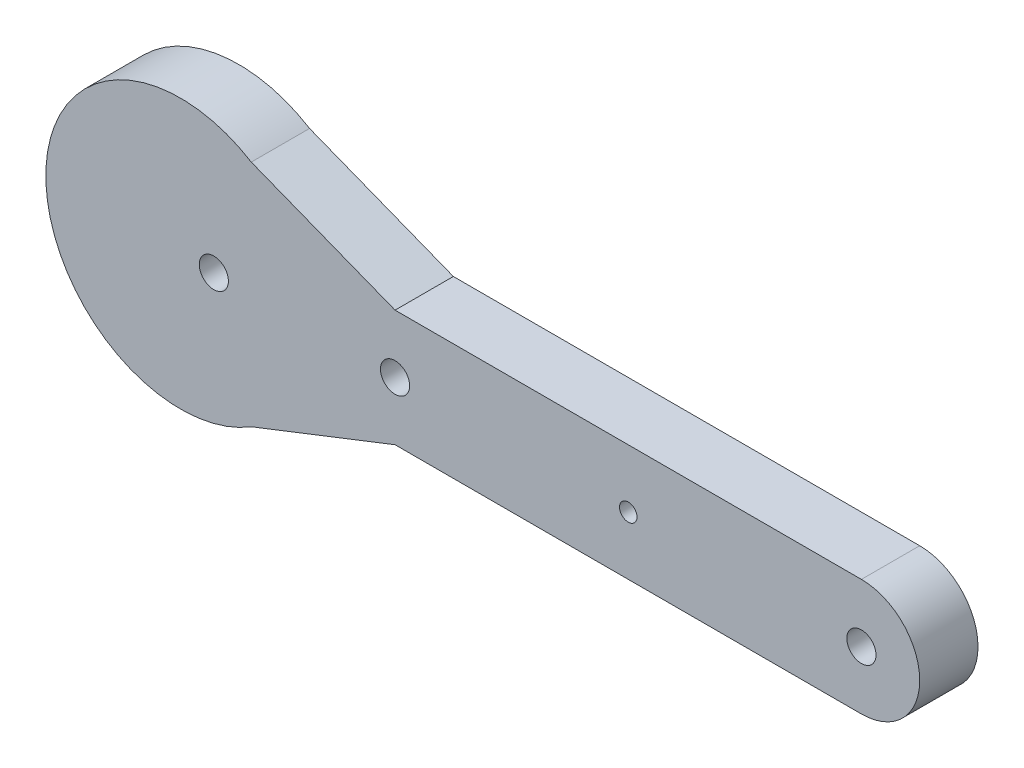
ISO-10303-21;
HEADER;
FILE_DESCRIPTION(('STEP AP214'),'2;1');
FILE_NAME('part.step','',(''),(''),'','','');
FILE_SCHEMA(('AUTOMOTIVE_DESIGN { 1 0 10303 214 1 1 1 1 }'));
ENDSEC;
DATA;
#1=APPLICATION_CONTEXT('core data for automotive mechanical design processes');
#2=APPLICATION_PROTOCOL_DEFINITION('international standard','automotive_design',2000,#1);
#3=PRODUCT_CONTEXT('',#1,'mechanical');
#4=PRODUCT('Part','Part','',(#3));
#5=PRODUCT_RELATED_PRODUCT_CATEGORY('part','',(#4));
#6=PRODUCT_DEFINITION_FORMATION('','',#4);
#7=PRODUCT_DEFINITION_CONTEXT('part definition',#1,'design');
#8=PRODUCT_DEFINITION('design','',#6,#7);
#9=PRODUCT_DEFINITION_SHAPE('','',#8);
#10=(LENGTH_UNIT() NAMED_UNIT(*) SI_UNIT(.MILLI.,.METRE.));
#11=(NAMED_UNIT(*) PLANE_ANGLE_UNIT() SI_UNIT($,.RADIAN.));
#12=(NAMED_UNIT(*) SI_UNIT($,.STERADIAN.) SOLID_ANGLE_UNIT());
#13=UNCERTAINTY_MEASURE_WITH_UNIT(LENGTH_MEASURE(1.E-05),#10,'distance_accuracy_value','');
#14=(GEOMETRIC_REPRESENTATION_CONTEXT(3) GLOBAL_UNCERTAINTY_ASSIGNED_CONTEXT((#13)) GLOBAL_UNIT_ASSIGNED_CONTEXT((#10,
#11,#12)) REPRESENTATION_CONTEXT('',''));
#15=CARTESIAN_POINT('',(0.,0.,0.));
#16=DIRECTION('',(0.,0.,1.));
#17=DIRECTION('',(1.,0.,0.));
#18=AXIS2_PLACEMENT_3D('',#15,#16,#17);
#19=CARTESIAN_POINT('',(-36.8077791148947,10.,10.));
#20=DIRECTION('',(0.,0.,1.));
#21=DIRECTION('',(1.,0.,0.));
#22=AXIS2_PLACEMENT_3D('',#19,#20,#21);
#23=PLANE('',#22);
#24=CARTESIAN_POINT('',(-31.0911194710237,10.,10.));
#25=DIRECTION('',(0.,0.,1.));
#26=DIRECTION('',(1.,0.,0.));
#27=AXIS2_PLACEMENT_3D('',#24,#25,#26);
#28=CIRCLE('',#27,2.5);
#29=CARTESIAN_POINT('',(-28.5911194710237,10.,10.));
#30=VERTEX_POINT('',#29);
#31=EDGE_CURVE('E189',#30,#30,#28,.T.);
#32=ORIENTED_EDGE('',*,*,#31,.F.);
#33=EDGE_LOOP('',(#32));
#34=FACE_BOUND('',#33,.T.);
#35=CARTESIAN_POINT('',(0.,10.,10.));
#36=DIRECTION('',(0.,0.,1.));
#37=DIRECTION('',(1.,0.,0.));
#38=AXIS2_PLACEMENT_3D('',#35,#36,#37);
#39=CIRCLE('',#38,2.5);
#40=CARTESIAN_POINT('',(2.5,10.,10.));
#41=VERTEX_POINT('',#40);
#42=EDGE_CURVE('E122',#41,#41,#39,.T.);
#43=ORIENTED_EDGE('',*,*,#42,.F.);
#44=EDGE_LOOP('',(#43));
#45=FACE_BOUND('',#44,.T.);
#46=DIRECTION('',(0.931166086788449,0.364595280845882,0.));
#47=VECTOR('',#46,1.);
#48=CARTESIAN_POINT('',(0.,0.,10.));
#49=LINE('',#48,#47);
#50=CARTESIAN_POINT('',(-24.6672867580171,-9.65840194445181,10.));
#51=VERTEX_POINT('',#50);
#52=CARTESIAN_POINT('',(0.,0.,10.));
#53=VERTEX_POINT('',#52);
#54=EDGE_CURVE('E129',#51,#53,#49,.T.);
#55=ORIENTED_EDGE('',*,*,#54,.T.);
#56=DIRECTION('',(1.,0.,0.));
#57=VECTOR('',#56,1.);
#58=CARTESIAN_POINT('',(0.,0.,10.));
#59=LINE('',#58,#57);
#60=CARTESIAN_POINT('',(80.,0.,10.));
#61=VERTEX_POINT('',#60);
#62=EDGE_CURVE('E87',#53,#61,#59,.T.);
#63=ORIENTED_EDGE('',*,*,#62,.T.);
#64=CARTESIAN_POINT('',(80.,10.,10.));
#65=DIRECTION('',(0.,0.,1.));
#66=DIRECTION('',(-1.,0.,0.));
#67=AXIS2_PLACEMENT_3D('',#64,#65,#66);
#68=CIRCLE('',#67,10.);
#69=CARTESIAN_POINT('',(80.,20.,10.));
#70=VERTEX_POINT('',#69);
#71=EDGE_CURVE('E100',#61,#70,#68,.T.);
#72=ORIENTED_EDGE('',*,*,#71,.T.);
#73=DIRECTION('',(-1.,0.,0.));
#74=VECTOR('',#73,1.);
#75=CARTESIAN_POINT('',(0.,20.,10.));
#76=LINE('',#75,#74);
#77=CARTESIAN_POINT('',(0.,20.,10.));
#78=VERTEX_POINT('',#77);
#79=EDGE_CURVE('E94',#70,#78,#76,.T.);
#80=ORIENTED_EDGE('',*,*,#79,.T.);
#81=DIRECTION('',(-0.931166086788448,0.364595280845882,0.));
#82=VECTOR('',#81,1.);
#83=CARTESIAN_POINT('',(0.,20.,10.));
#84=LINE('',#83,#82);
#85=CARTESIAN_POINT('',(-24.6672867580171,29.6584019444518,10.));
#86=VERTEX_POINT('',#85);
#87=EDGE_CURVE('E98',#78,#86,#84,.T.);
#88=ORIENTED_EDGE('',*,*,#87,.T.);
#89=CARTESIAN_POINT('',(-36.8077791148947,10.,10.));
#90=DIRECTION('',(0.,0.,1.));
#91=DIRECTION('',(1.,0.,0.));
#92=AXIS2_PLACEMENT_3D('',#89,#90,#91);
#93=CIRCLE('',#92,23.1050713410937);
#94=EDGE_CURVE('E50',#86,#51,#93,.T.);
#95=ORIENTED_EDGE('',*,*,#94,.T.);
#96=EDGE_LOOP('',(#55,#63,#72,#80,#88,#95));
#97=FACE_BOUND('',#96,.T.);
#98=CARTESIAN_POINT('',(80.,10.,10.));
#99=DIRECTION('',(0.,0.,1.));
#100=DIRECTION('',(1.,0.,0.));
#101=AXIS2_PLACEMENT_3D('',#98,#99,#100);
#102=CIRCLE('',#101,2.50000000000001);
#103=CARTESIAN_POINT('',(82.5,10.,10.));
#104=VERTEX_POINT('',#103);
#105=EDGE_CURVE('E195',#104,#104,#102,.T.);
#106=ORIENTED_EDGE('',*,*,#105,.F.);
#107=EDGE_LOOP('',(#106));
#108=FACE_BOUND('',#107,.T.);
#109=CARTESIAN_POINT('',(40.,9.99999999999999,10.));
#110=DIRECTION('',(0.,0.,1.));
#111=DIRECTION('',(1.,0.,0.));
#112=AXIS2_PLACEMENT_3D('',#109,#110,#111);
#113=CIRCLE('',#112,1.5);
#114=CARTESIAN_POINT('',(41.5,9.99999999999999,10.));
#115=VERTEX_POINT('',#114);
#116=EDGE_CURVE('E180',#115,#115,#113,.T.);
#117=ORIENTED_EDGE('',*,*,#116,.F.);
#118=EDGE_LOOP('',(#117));
#119=FACE_BOUND('',#118,.T.);
#120=ADVANCED_FACE('F33',(#34,#45,#97,#108,#119),#23,.T.);
#121=CARTESIAN_POINT('',(-36.8077791148947,10.,0.));
#122=DIRECTION('',(0.,0.,1.));
#123=DIRECTION('',(1.,0.,0.));
#124=AXIS2_PLACEMENT_3D('',#121,#122,#123);
#125=PLANE('',#124);
#126=DIRECTION('',(0.931166086788449,0.364595280845882,0.));
#127=VECTOR('',#126,1.);
#128=CARTESIAN_POINT('',(0.,0.,0.));
#129=LINE('',#128,#127);
#130=CARTESIAN_POINT('',(-24.6672867580171,-9.65840194445181,0.));
#131=VERTEX_POINT('',#130);
#132=CARTESIAN_POINT('',(0.,0.,0.));
#133=VERTEX_POINT('',#132);
#134=EDGE_CURVE('E118',#131,#133,#129,.T.);
#135=ORIENTED_EDGE('',*,*,#134,.F.);
#136=CARTESIAN_POINT('',(-36.8077791148947,10.,0.));
#137=DIRECTION('',(0.,0.,1.));
#138=DIRECTION('',(1.,0.,0.));
#139=AXIS2_PLACEMENT_3D('',#136,#137,#138);
#140=CIRCLE('',#139,23.1050713410937);
#141=CARTESIAN_POINT('',(-24.6672867580171,29.6584019444518,0.));
#142=VERTEX_POINT('',#141);
#143=EDGE_CURVE('E79',#142,#131,#140,.T.);
#144=ORIENTED_EDGE('',*,*,#143,.F.);
#145=DIRECTION('',(-0.931166086788448,0.364595280845882,0.));
#146=VECTOR('',#145,1.);
#147=CARTESIAN_POINT('',(0.,20.,0.));
#148=LINE('',#147,#146);
#149=CARTESIAN_POINT('',(0.,20.,0.));
#150=VERTEX_POINT('',#149);
#151=EDGE_CURVE('E73',#150,#142,#148,.T.);
#152=ORIENTED_EDGE('',*,*,#151,.F.);
#153=DIRECTION('',(-1.,0.,0.));
#154=VECTOR('',#153,1.);
#155=CARTESIAN_POINT('',(0.,20.,0.));
#156=LINE('',#155,#154);
#157=CARTESIAN_POINT('',(80.,20.,0.));
#158=VERTEX_POINT('',#157);
#159=EDGE_CURVE('E108',#158,#150,#156,.T.);
#160=ORIENTED_EDGE('',*,*,#159,.F.);
#161=CARTESIAN_POINT('',(80.,10.,0.));
#162=DIRECTION('',(0.,0.,1.));
#163=DIRECTION('',(-1.,0.,0.));
#164=AXIS2_PLACEMENT_3D('',#161,#162,#163);
#165=CIRCLE('',#164,10.);
#166=CARTESIAN_POINT('',(80.,0.,0.));
#167=VERTEX_POINT('',#166);
#168=EDGE_CURVE('E124',#167,#158,#165,.T.);
#169=ORIENTED_EDGE('',*,*,#168,.F.);
#170=DIRECTION('',(1.,0.,0.));
#171=VECTOR('',#170,1.);
#172=CARTESIAN_POINT('',(0.,0.,0.));
#173=LINE('',#172,#171);
#174=EDGE_CURVE('E121',#133,#167,#173,.T.);
#175=ORIENTED_EDGE('',*,*,#174,.F.);
#176=EDGE_LOOP('',(#135,#144,#152,#160,#169,#175));
#177=FACE_BOUND('',#176,.T.);
#178=CARTESIAN_POINT('',(0.,10.,0.));
#179=DIRECTION('',(0.,0.,1.));
#180=DIRECTION('',(1.,0.,0.));
#181=AXIS2_PLACEMENT_3D('',#178,#179,#180);
#182=CIRCLE('',#181,2.5);
#183=CARTESIAN_POINT('',(2.5,10.,0.));
#184=VERTEX_POINT('',#183);
#185=EDGE_CURVE('E198',#184,#184,#182,.T.);
#186=ORIENTED_EDGE('',*,*,#185,.T.);
#187=EDGE_LOOP('',(#186));
#188=FACE_BOUND('',#187,.T.);
#189=CARTESIAN_POINT('',(80.,10.,0.));
#190=DIRECTION('',(0.,0.,1.));
#191=DIRECTION('',(1.,0.,0.));
#192=AXIS2_PLACEMENT_3D('',#189,#190,#191);
#193=CIRCLE('',#192,2.50000000000001);
#194=CARTESIAN_POINT('',(82.5,10.,0.));
#195=VERTEX_POINT('',#194);
#196=EDGE_CURVE('E192',#195,#195,#193,.T.);
#197=ORIENTED_EDGE('',*,*,#196,.T.);
#198=EDGE_LOOP('',(#197));
#199=FACE_BOUND('',#198,.T.);
#200=CARTESIAN_POINT('',(-31.0911194710237,10.,0.));
#201=DIRECTION('',(0.,0.,1.));
#202=DIRECTION('',(1.,0.,0.));
#203=AXIS2_PLACEMENT_3D('',#200,#201,#202);
#204=CIRCLE('',#203,2.5);
#205=CARTESIAN_POINT('',(-28.5911194710237,10.,0.));
#206=VERTEX_POINT('',#205);
#207=EDGE_CURVE('E186',#206,#206,#204,.T.);
#208=ORIENTED_EDGE('',*,*,#207,.T.);
#209=EDGE_LOOP('',(#208));
#210=FACE_BOUND('',#209,.T.);
#211=CARTESIAN_POINT('',(40.,9.99999999999999,0.));
#212=DIRECTION('',(0.,0.,1.));
#213=DIRECTION('',(1.,0.,0.));
#214=AXIS2_PLACEMENT_3D('',#211,#212,#213);
#215=CIRCLE('',#214,1.5);
#216=CARTESIAN_POINT('',(41.5,9.99999999999999,0.));
#217=VERTEX_POINT('',#216);
#218=EDGE_CURVE('E183',#217,#217,#215,.T.);
#219=ORIENTED_EDGE('',*,*,#218,.T.);
#220=EDGE_LOOP('',(#219));
#221=FACE_BOUND('',#220,.T.);
#222=ADVANCED_FACE('F138',(#177,#188,#199,#210,#221),#125,.F.);
#223=CARTESIAN_POINT('',(0.,0.,10.));
#224=DIRECTION('',(-0.364595280845882,0.931166086788449,0.));
#225=DIRECTION('',(-0.931166086788449,-0.364595280845882,0.));
#226=AXIS2_PLACEMENT_3D('',#223,#224,#225);
#227=PLANE('',#226);
#228=ORIENTED_EDGE('',*,*,#134,.T.);
#229=DIRECTION('',(0.,0.,-1.));
#230=VECTOR('',#229,1.);
#231=CARTESIAN_POINT('',(0.,0.,10.));
#232=LINE('',#231,#230);
#233=EDGE_CURVE('E11',#53,#133,#232,.T.);
#234=ORIENTED_EDGE('',*,*,#233,.F.);
#235=ORIENTED_EDGE('',*,*,#54,.F.);
#236=DIRECTION('',(0.,0.,-1.));
#237=VECTOR('',#236,1.);
#238=CARTESIAN_POINT('',(-24.6672867580171,-9.65840194445181,10.));
#239=LINE('',#238,#237);
#240=EDGE_CURVE('E114',#51,#131,#239,.T.);
#241=ORIENTED_EDGE('',*,*,#240,.T.);
#242=EDGE_LOOP('',(#228,#234,#235,#241));
#243=FACE_BOUND('',#242,.T.);
#244=ADVANCED_FACE('F35',(#243),#227,.F.);
#245=CARTESIAN_POINT('',(0.,0.,10.));
#246=DIRECTION('',(0.,1.,0.));
#247=DIRECTION('',(0.,0.,1.));
#248=AXIS2_PLACEMENT_3D('',#245,#246,#247);
#249=PLANE('',#248);
#250=ORIENTED_EDGE('',*,*,#174,.T.);
#251=DIRECTION('',(0.,0.,-1.));
#252=VECTOR('',#251,1.);
#253=CARTESIAN_POINT('',(80.,0.,10.));
#254=LINE('',#253,#252);
#255=EDGE_CURVE('E42',#61,#167,#254,.T.);
#256=ORIENTED_EDGE('',*,*,#255,.F.);
#257=ORIENTED_EDGE('',*,*,#62,.F.);
#258=ORIENTED_EDGE('',*,*,#233,.T.);
#259=EDGE_LOOP('',(#250,#256,#257,#258));
#260=FACE_BOUND('',#259,.T.);
#261=ADVANCED_FACE('F256',(#260),#249,.F.);
#262=CARTESIAN_POINT('',(80.,10.,10.));
#263=DIRECTION('',(0.,0.,-1.));
#264=DIRECTION('',(-1.,0.,0.));
#265=AXIS2_PLACEMENT_3D('',#262,#263,#264);
#266=CYLINDRICAL_SURFACE('',#265,10.);
#267=ORIENTED_EDGE('',*,*,#168,.T.);
#268=DIRECTION('',(0.,0.,-1.));
#269=VECTOR('',#268,1.);
#270=CARTESIAN_POINT('',(80.,20.,10.));
#271=LINE('',#270,#269);
#272=EDGE_CURVE('E109',#70,#158,#271,.T.);
#273=ORIENTED_EDGE('',*,*,#272,.F.);
#274=ORIENTED_EDGE('',*,*,#71,.F.);
#275=ORIENTED_EDGE('',*,*,#255,.T.);
#276=EDGE_LOOP('',(#267,#273,#274,#275));
#277=FACE_BOUND('',#276,.T.);
#278=ADVANCED_FACE('F135',(#277),#266,.T.);
#279=CARTESIAN_POINT('',(0.,20.,10.));
#280=DIRECTION('',(0.,-1.,0.));
#281=DIRECTION('',(0.,0.,-1.));
#282=AXIS2_PLACEMENT_3D('',#279,#280,#281);
#283=PLANE('',#282);
#284=ORIENTED_EDGE('',*,*,#159,.T.);
#285=DIRECTION('',(0.,0.,-1.));
#286=VECTOR('',#285,1.);
#287=CARTESIAN_POINT('',(0.,20.,10.));
#288=LINE('',#287,#286);
#289=EDGE_CURVE('E105',#78,#150,#288,.T.);
#290=ORIENTED_EDGE('',*,*,#289,.F.);
#291=ORIENTED_EDGE('',*,*,#79,.F.);
#292=ORIENTED_EDGE('',*,*,#272,.T.);
#293=EDGE_LOOP('',(#284,#290,#291,#292));
#294=FACE_BOUND('',#293,.T.);
#295=ADVANCED_FACE('F106',(#294),#283,.F.);
#296=CARTESIAN_POINT('',(0.,20.,10.));
#297=DIRECTION('',(-0.364595280845882,-0.931166086788449,0.));
#298=DIRECTION('',(0.931166086788449,-0.364595280845882,0.));
#299=AXIS2_PLACEMENT_3D('',#296,#297,#298);
#300=PLANE('',#299);
#301=ORIENTED_EDGE('',*,*,#151,.T.);
#302=DIRECTION('',(0.,0.,-1.));
#303=VECTOR('',#302,1.);
#304=CARTESIAN_POINT('',(-24.6672867580171,29.6584019444518,10.));
#305=LINE('',#304,#303);
#306=EDGE_CURVE('E110',#86,#142,#305,.T.);
#307=ORIENTED_EDGE('',*,*,#306,.F.);
#308=ORIENTED_EDGE('',*,*,#87,.F.);
#309=ORIENTED_EDGE('',*,*,#289,.T.);
#310=EDGE_LOOP('',(#301,#307,#308,#309));
#311=FACE_BOUND('',#310,.T.);
#312=ADVANCED_FACE('F112',(#311),#300,.F.);
#313=CARTESIAN_POINT('',(-36.8077791148947,10.,10.));
#314=DIRECTION('',(0.,0.,-1.));
#315=DIRECTION('',(-1.,0.,0.));
#316=AXIS2_PLACEMENT_3D('',#313,#314,#315);
#317=CYLINDRICAL_SURFACE('',#316,23.1050713410937);
#318=ORIENTED_EDGE('',*,*,#143,.T.);
#319=ORIENTED_EDGE('',*,*,#240,.F.);
#320=ORIENTED_EDGE('',*,*,#94,.F.);
#321=ORIENTED_EDGE('',*,*,#306,.T.);
#322=EDGE_LOOP('',(#318,#319,#320,#321));
#323=FACE_BOUND('',#322,.T.);
#324=ADVANCED_FACE('F143',(#323),#317,.T.);
#325=CARTESIAN_POINT('',(0.,10.,10.));
#326=DIRECTION('',(0.,0.,-1.));
#327=DIRECTION('',(-1.,0.,0.));
#328=AXIS2_PLACEMENT_3D('',#325,#326,#327);
#329=CYLINDRICAL_SURFACE('',#328,2.5);
#330=ORIENTED_EDGE('',*,*,#42,.T.);
#331=EDGE_LOOP('',(#330));
#332=FACE_BOUND('',#331,.T.);
#333=ORIENTED_EDGE('',*,*,#185,.F.);
#334=EDGE_LOOP('',(#333));
#335=FACE_BOUND('',#334,.T.);
#336=ADVANCED_FACE('F145',(#332,#335),#329,.F.);
#337=CARTESIAN_POINT('',(80.,10.,10.));
#338=DIRECTION('',(0.,0.,-1.));
#339=DIRECTION('',(-1.,0.,0.));
#340=AXIS2_PLACEMENT_3D('',#337,#338,#339);
#341=CYLINDRICAL_SURFACE('',#340,2.50000000000001);
#342=ORIENTED_EDGE('',*,*,#105,.T.);
#343=EDGE_LOOP('',(#342));
#344=FACE_BOUND('',#343,.T.);
#345=ORIENTED_EDGE('',*,*,#196,.F.);
#346=EDGE_LOOP('',(#345));
#347=FACE_BOUND('',#346,.T.);
#348=ADVANCED_FACE('F151',(#344,#347),#341,.F.);
#349=CARTESIAN_POINT('',(-31.0911194710237,10.,10.));
#350=DIRECTION('',(0.,0.,-1.));
#351=DIRECTION('',(-1.,0.,0.));
#352=AXIS2_PLACEMENT_3D('',#349,#350,#351);
#353=CYLINDRICAL_SURFACE('',#352,2.5);
#354=ORIENTED_EDGE('',*,*,#31,.T.);
#355=EDGE_LOOP('',(#354));
#356=FACE_BOUND('',#355,.T.);
#357=ORIENTED_EDGE('',*,*,#207,.F.);
#358=EDGE_LOOP('',(#357));
#359=FACE_BOUND('',#358,.T.);
#360=ADVANCED_FACE('F167',(#356,#359),#353,.F.);
#361=CARTESIAN_POINT('',(40.,9.99999999999999,10.));
#362=DIRECTION('',(0.,0.,-1.));
#363=DIRECTION('',(-1.,0.,0.));
#364=AXIS2_PLACEMENT_3D('',#361,#362,#363);
#365=CYLINDRICAL_SURFACE('',#364,1.5);
#366=ORIENTED_EDGE('',*,*,#116,.T.);
#367=EDGE_LOOP('',(#366));
#368=FACE_BOUND('',#367,.T.);
#369=ORIENTED_EDGE('',*,*,#218,.F.);
#370=EDGE_LOOP('',(#369));
#371=FACE_BOUND('',#370,.T.);
#372=ADVANCED_FACE('F171',(#368,#371),#365,.F.);
#373=CLOSED_SHELL('',(#120,#222,#244,#261,#278,#295,#312,#324,#336,#348,#360,#372));
#374=MANIFOLD_SOLID_BREP('B2',#373);
#375=ADVANCED_BREP_SHAPE_REPRESENTATION('',(#18,#374),#14);
#376=SHAPE_DEFINITION_REPRESENTATION(#9,#375);
ENDSEC;
END-ISO-10303-21;
